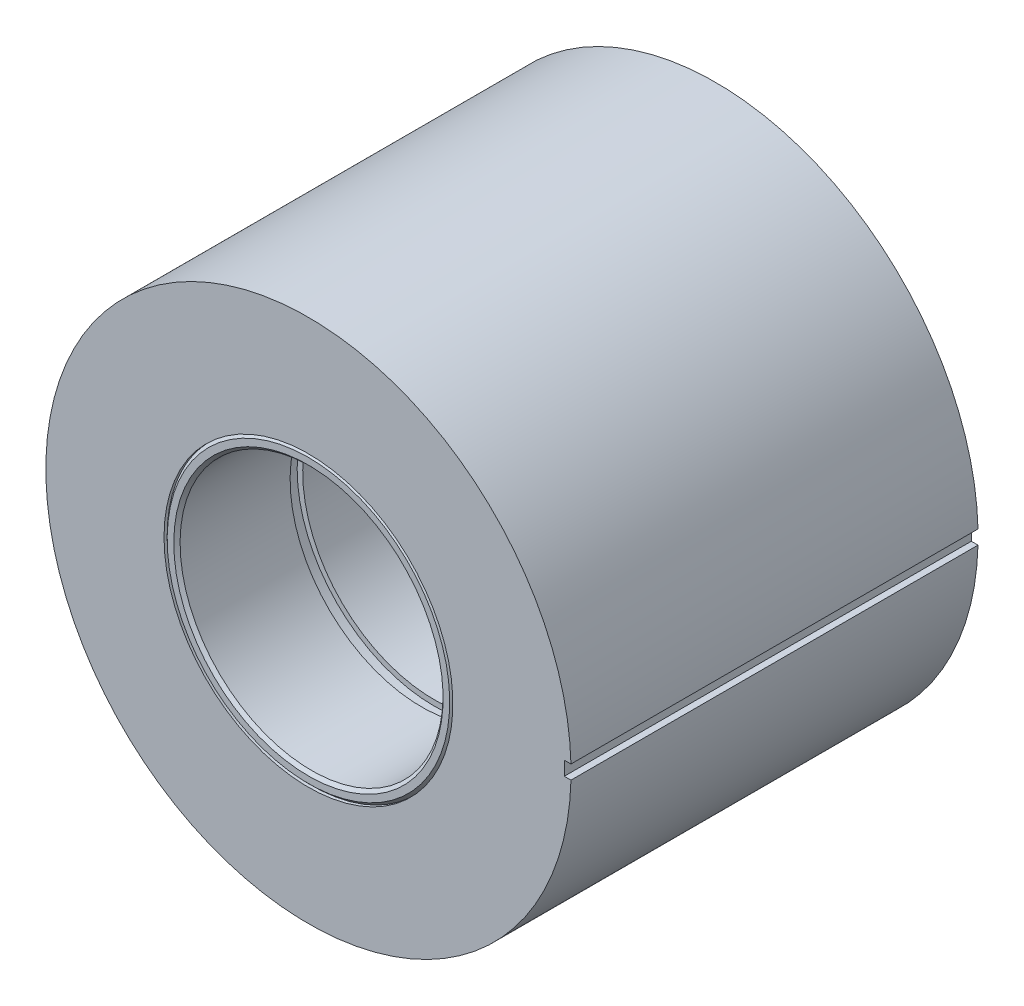
ISO-10303-21;
HEADER;
FILE_DESCRIPTION(('STEP AP214'),'2;1');
FILE_NAME('part.step','',(''),(''),'','','');
FILE_SCHEMA(('AUTOMOTIVE_DESIGN { 1 0 10303 214 1 1 1 1 }'));
ENDSEC;
DATA;
#1=APPLICATION_CONTEXT('core data for automotive mechanical design processes');
#2=APPLICATION_PROTOCOL_DEFINITION('international standard','automotive_design',2000,#1);
#3=PRODUCT_CONTEXT('',#1,'mechanical');
#4=PRODUCT('Part','Part','',(#3));
#5=PRODUCT_RELATED_PRODUCT_CATEGORY('part','',(#4));
#6=PRODUCT_DEFINITION_FORMATION('','',#4);
#7=PRODUCT_DEFINITION_CONTEXT('part definition',#1,'design');
#8=PRODUCT_DEFINITION('design','',#6,#7);
#9=PRODUCT_DEFINITION_SHAPE('','',#8);
#10=(LENGTH_UNIT() NAMED_UNIT(*) SI_UNIT(.MILLI.,.METRE.));
#11=(NAMED_UNIT(*) PLANE_ANGLE_UNIT() SI_UNIT($,.RADIAN.));
#12=(NAMED_UNIT(*) SI_UNIT($,.STERADIAN.) SOLID_ANGLE_UNIT());
#13=UNCERTAINTY_MEASURE_WITH_UNIT(LENGTH_MEASURE(1.E-05),#10,'distance_accuracy_value','');
#14=(GEOMETRIC_REPRESENTATION_CONTEXT(3) GLOBAL_UNCERTAINTY_ASSIGNED_CONTEXT((#13)) GLOBAL_UNIT_ASSIGNED_CONTEXT((#10,
#11,#12)) REPRESENTATION_CONTEXT('',''));
#15=CARTESIAN_POINT('',(0.,0.,0.));
#16=DIRECTION('',(0.,0.,1.));
#17=DIRECTION('',(1.,0.,0.));
#18=AXIS2_PLACEMENT_3D('',#15,#16,#17);
#19=CARTESIAN_POINT('',(0.,0.,0.));
#20=DIRECTION('',(0.,0.,-1.));
#21=DIRECTION('',(-1.,0.,0.));
#22=AXIS2_PLACEMENT_3D('',#19,#20,#21);
#23=CYLINDRICAL_SURFACE('',#22,17.4625);
#24=CARTESIAN_POINT('',(0.,0.,-49.2125));
#25=DIRECTION('',(0.,0.,-1.));
#26=DIRECTION('',(-1.,0.,0.));
#27=AXIS2_PLACEMENT_3D('',#24,#25,#26);
#28=CIRCLE('',#27,17.4625);
#29=CARTESIAN_POINT('',(-17.4625,0.,-49.2125));
#30=VERTEX_POINT('',#29);
#31=EDGE_CURVE('P0_E100',#30,#30,#28,.T.);
#32=ORIENTED_EDGE('',*,*,#31,.T.);
#33=EDGE_LOOP('',(#32));
#34=FACE_BOUND('',#33,.T.);
#35=CARTESIAN_POINT('',(0.,0.,0.));
#36=DIRECTION('',(0.,0.,-1.));
#37=DIRECTION('',(-1.,0.,0.));
#38=AXIS2_PLACEMENT_3D('',#35,#36,#37);
#39=CIRCLE('',#38,17.4625);
#40=CARTESIAN_POINT('',(-17.4625,0.,0.));
#41=VERTEX_POINT('',#40);
#42=EDGE_CURVE('P0_E107',#41,#41,#39,.T.);
#43=ORIENTED_EDGE('',*,*,#42,.F.);
#44=EDGE_LOOP('',(#43));
#45=FACE_BOUND('',#44,.T.);
#46=ADVANCED_FACE('P0_F38',(#34,#45),#23,.F.);
#47=CARTESIAN_POINT('',(0.,0.,-49.2125));
#48=DIRECTION('',(0.,0.,1.));
#49=DIRECTION('',(1.,0.,0.));
#50=AXIS2_PLACEMENT_3D('',#47,#48,#49);
#51=PLANE('',#50);
#52=DIRECTION('',(0.,1.,0.));
#53=VECTOR('',#52,1.);
#54=CARTESIAN_POINT('',(30.9323552674912,0.8436038931805,-49.2125));
#55=LINE('',#54,#53);
#56=CARTESIAN_POINT('',(30.9323552674912,-0.8436038931805,-49.2125));
#57=VERTEX_POINT('',#56);
#58=CARTESIAN_POINT('',(30.9323552674912,0.8436038931805,-49.2125));
#59=VERTEX_POINT('',#58);
#60=EDGE_CURVE('P0_E81',#57,#59,#55,.T.);
#61=ORIENTED_EDGE('',*,*,#60,.F.);
#62=DIRECTION('',(-1.,0.,0.));
#63=VECTOR('',#62,1.);
#64=CARTESIAN_POINT('',(32.5676447325088,-0.8436038931805,-49.2125));
#65=LINE('',#64,#63);
#66=CARTESIAN_POINT('',(31.7387906586154,-0.8436038931805,-49.2125));
#67=VERTEX_POINT('',#66);
#68=EDGE_CURVE('P0_E93',#67,#57,#65,.T.);
#69=ORIENTED_EDGE('',*,*,#68,.F.);
#70=CARTESIAN_POINT('',(0.,0.,-49.2125));
#71=DIRECTION('',(0.,0.,1.));
#72=DIRECTION('',(1.,0.,0.));
#73=AXIS2_PLACEMENT_3D('',#70,#71,#72);
#74=CIRCLE('',#73,31.75);
#75=CARTESIAN_POINT('',(31.7387906586154,0.8436038931805,-49.2125));
#76=VERTEX_POINT('',#75);
#77=EDGE_CURVE('P0_E104',#76,#67,#74,.T.);
#78=ORIENTED_EDGE('',*,*,#77,.F.);
#79=DIRECTION('',(1.,0.,0.));
#80=VECTOR('',#79,1.);
#81=CARTESIAN_POINT('',(32.5676447325088,0.8436038931805,-49.2125));
#82=LINE('',#81,#80);
#83=EDGE_CURVE('P0_E51',#59,#76,#82,.T.);
#84=ORIENTED_EDGE('',*,*,#83,.F.);
#85=EDGE_LOOP('',(#61,#69,#78,#84));
#86=FACE_BOUND('',#85,.T.);
#87=ORIENTED_EDGE('',*,*,#31,.F.);
#88=EDGE_LOOP('',(#87));
#89=FACE_BOUND('',#88,.T.);
#90=ADVANCED_FACE('P0_F116',(#86,#89),#51,.F.);
#91=CARTESIAN_POINT('',(0.,0.,0.));
#92=DIRECTION('',(0.,0.,1.));
#93=DIRECTION('',(1.,0.,0.));
#94=AXIS2_PLACEMENT_3D('',#91,#92,#93);
#95=PLANE('',#94);
#96=DIRECTION('',(-1.,0.,0.));
#97=VECTOR('',#96,1.);
#98=CARTESIAN_POINT('',(32.5676447325088,-0.8436038931805,0.));
#99=LINE('',#98,#97);
#100=CARTESIAN_POINT('',(31.7387906586154,-0.8436038931805,0.));
#101=VERTEX_POINT('',#100);
#102=CARTESIAN_POINT('',(30.9323552674912,-0.8436038931805,0.));
#103=VERTEX_POINT('',#102);
#104=EDGE_CURVE('P0_E83',#101,#103,#99,.T.);
#105=ORIENTED_EDGE('',*,*,#104,.T.);
#106=DIRECTION('',(0.,1.,0.));
#107=VECTOR('',#106,1.);
#108=CARTESIAN_POINT('',(30.9323552674912,0.8436038931805,0.));
#109=LINE('',#108,#107);
#110=CARTESIAN_POINT('',(30.9323552674912,0.8436038931805,0.));
#111=VERTEX_POINT('',#110);
#112=EDGE_CURVE('P0_E78',#103,#111,#109,.T.);
#113=ORIENTED_EDGE('',*,*,#112,.T.);
#114=DIRECTION('',(1.,0.,0.));
#115=VECTOR('',#114,1.);
#116=CARTESIAN_POINT('',(32.5676447325088,0.8436038931805,0.));
#117=LINE('',#116,#115);
#118=CARTESIAN_POINT('',(31.7387906586154,0.8436038931805,0.));
#119=VERTEX_POINT('',#118);
#120=EDGE_CURVE('P0_E85',#111,#119,#117,.T.);
#121=ORIENTED_EDGE('',*,*,#120,.T.);
#122=CARTESIAN_POINT('',(0.,0.,0.));
#123=DIRECTION('',(0.,0.,1.));
#124=DIRECTION('',(1.,0.,0.));
#125=AXIS2_PLACEMENT_3D('',#122,#123,#124);
#126=CIRCLE('',#125,31.75);
#127=EDGE_CURVE('P0_E102',#101,#119,#126,.F.);
#128=ORIENTED_EDGE('',*,*,#127,.F.);
#129=EDGE_LOOP('',(#105,#113,#121,#128));
#130=FACE_BOUND('',#129,.T.);
#131=ORIENTED_EDGE('',*,*,#42,.T.);
#132=EDGE_LOOP('',(#131));
#133=FACE_BOUND('',#132,.T.);
#134=ADVANCED_FACE('P0_F91',(#130,#133),#95,.T.);
#135=CARTESIAN_POINT('',(0.,0.,-49.2125));
#136=DIRECTION('',(0.,0.,1.));
#137=DIRECTION('',(1.,0.,0.));
#138=AXIS2_PLACEMENT_3D('',#135,#136,#137);
#139=CYLINDRICAL_SURFACE('',#138,31.75);
#140=DIRECTION('',(0.,0.,1.));
#141=VECTOR('',#140,1.);
#142=CARTESIAN_POINT('',(31.7387906586154,-0.8436038931805,-49.2125));
#143=LINE('',#142,#141);
#144=EDGE_CURVE('P0_E12',#101,#67,#143,.F.);
#145=ORIENTED_EDGE('',*,*,#144,.F.);
#146=ORIENTED_EDGE('',*,*,#127,.T.);
#147=DIRECTION('',(0.,0.,1.));
#148=VECTOR('',#147,1.);
#149=CARTESIAN_POINT('',(31.7387906586154,0.8436038931805,-49.2125));
#150=LINE('',#149,#148);
#151=EDGE_CURVE('P0_E44',#76,#119,#150,.T.);
#152=ORIENTED_EDGE('',*,*,#151,.F.);
#153=ORIENTED_EDGE('',*,*,#77,.T.);
#154=EDGE_LOOP('',(#145,#146,#152,#153));
#155=FACE_BOUND('',#154,.T.);
#156=ADVANCED_FACE('P0_F123',(#155),#139,.T.);
#157=CARTESIAN_POINT('',(30.9323552674912,0.8436038931805,0.));
#158=DIRECTION('',(-1.,0.,0.));
#159=DIRECTION('',(0.,0.,1.));
#160=AXIS2_PLACEMENT_3D('',#157,#158,#159);
#161=PLANE('',#160);
#162=ORIENTED_EDGE('',*,*,#60,.T.);
#163=DIRECTION('',(0.,0.,-1.));
#164=VECTOR('',#163,1.);
#165=CARTESIAN_POINT('',(30.9323552674912,0.8436038931805,0.));
#166=LINE('',#165,#164);
#167=EDGE_CURVE('P0_E74',#111,#59,#166,.T.);
#168=ORIENTED_EDGE('',*,*,#167,.F.);
#169=ORIENTED_EDGE('',*,*,#112,.F.);
#170=DIRECTION('',(0.,0.,-1.));
#171=VECTOR('',#170,1.);
#172=CARTESIAN_POINT('',(30.9323552674912,-0.8436038931805,0.));
#173=LINE('',#172,#171);
#174=EDGE_CURVE('P0_E82',#103,#57,#173,.T.);
#175=ORIENTED_EDGE('',*,*,#174,.T.);
#176=EDGE_LOOP('',(#162,#168,#169,#175));
#177=FACE_BOUND('',#176,.T.);
#178=ADVANCED_FACE('P0_F75',(#177),#161,.F.);
#179=CARTESIAN_POINT('',(32.5676447325088,-0.8436038931805,0.));
#180=DIRECTION('',(0.,-1.,0.));
#181=DIRECTION('',(0.,0.,-1.));
#182=AXIS2_PLACEMENT_3D('',#179,#180,#181);
#183=PLANE('',#182);
#184=ORIENTED_EDGE('',*,*,#144,.T.);
#185=ORIENTED_EDGE('',*,*,#68,.T.);
#186=ORIENTED_EDGE('',*,*,#174,.F.);
#187=ORIENTED_EDGE('',*,*,#104,.F.);
#188=EDGE_LOOP('',(#184,#185,#186,#187));
#189=FACE_BOUND('',#188,.T.);
#190=ADVANCED_FACE('P0_F131',(#189),#183,.F.);
#191=CARTESIAN_POINT('',(32.5676447325088,0.8436038931805,0.));
#192=DIRECTION('',(0.,1.,0.));
#193=DIRECTION('',(0.,0.,1.));
#194=AXIS2_PLACEMENT_3D('',#191,#192,#193);
#195=PLANE('',#194);
#196=ORIENTED_EDGE('',*,*,#151,.T.);
#197=ORIENTED_EDGE('',*,*,#120,.F.);
#198=ORIENTED_EDGE('',*,*,#167,.T.);
#199=ORIENTED_EDGE('',*,*,#83,.T.);
#200=EDGE_LOOP('',(#196,#197,#198,#199));
#201=FACE_BOUND('',#200,.T.);
#202=ADVANCED_FACE('P0_F86',(#201),#195,.F.);
#203=CLOSED_SHELL('',(#46,#90,#134,#156,#178,#190,#202));
#204=MANIFOLD_SOLID_BREP('P0_B2',#203);
#205=CARTESIAN_POINT('',(0.,0.,-49.2125));
#206=DIRECTION('',(0.,0.,1.));
#207=DIRECTION('',(-0.923728021347068,-0.383049008063238,0.));
#208=AXIS2_PLACEMENT_3D('',#205,#206,#207);
#209=CYLINDRICAL_SURFACE('',#208,15.9004);
#210=CARTESIAN_POINT('',(0.,0.,-15.20825));
#211=DIRECTION('',(0.,0.,1.));
#212=DIRECTION('',(-0.923728021347068,-0.383049008063238,0.));
#213=AXIS2_PLACEMENT_3D('',#210,#211,#212);
#214=CIRCLE('',#213,15.9004);
#215=CARTESIAN_POINT('',(-14.6876450306269,-6.0906324478087,-15.20825));
#216=VERTEX_POINT('',#215);
#217=EDGE_CURVE('P1_E63',#216,#216,#214,.T.);
#218=ORIENTED_EDGE('',*,*,#217,.T.);
#219=EDGE_LOOP('',(#218));
#220=FACE_BOUND('',#219,.T.);
#221=CARTESIAN_POINT('',(0.,0.,-34.00425));
#222=DIRECTION('',(0.,0.,1.));
#223=DIRECTION('',(-0.923728021347068,-0.383049008063238,0.));
#224=AXIS2_PLACEMENT_3D('',#221,#222,#223);
#225=CIRCLE('',#224,15.9004);
#226=CARTESIAN_POINT('',(-14.6876450306269,-6.0906324478087,-34.00425));
#227=VERTEX_POINT('',#226);
#228=EDGE_CURVE('P1_E17',#227,#227,#225,.T.);
#229=ORIENTED_EDGE('',*,*,#228,.F.);
#230=EDGE_LOOP('',(#229));
#231=FACE_BOUND('',#230,.T.);
#232=ADVANCED_FACE('P1_F14',(#220,#231),#209,.F.);
#233=CARTESIAN_POINT('',(0.,0.,-34.00425));
#234=DIRECTION('',(0.,0.,-1.));
#235=DIRECTION('',(0.923728021347068,0.383049008063238,0.));
#236=AXIS2_PLACEMENT_3D('',#233,#234,#235);
#237=PLANE('',#236);
#238=CARTESIAN_POINT('',(0.,0.,-34.00425));
#239=DIRECTION('',(0.,0.,1.));
#240=DIRECTION('',(-0.923728021347068,-0.383049008063238,0.));
#241=AXIS2_PLACEMENT_3D('',#238,#239,#240);
#242=CIRCLE('',#241,16.5735);
#243=CARTESIAN_POINT('',(-15.3094063617956,-6.34846273513607,-34.00425));
#244=VERTEX_POINT('',#243);
#245=EDGE_CURVE('P1_E61',#244,#244,#242,.F.);
#246=ORIENTED_EDGE('',*,*,#245,.T.);
#247=EDGE_LOOP('',(#246));
#248=FACE_BOUND('',#247,.T.);
#249=ORIENTED_EDGE('',*,*,#228,.T.);
#250=EDGE_LOOP('',(#249));
#251=FACE_BOUND('',#250,.T.);
#252=ADVANCED_FACE('P1_F70',(#248,#251),#237,.T.);
#253=CARTESIAN_POINT('',(0.,0.,-15.20825));
#254=DIRECTION('',(0.,0.,-1.));
#255=DIRECTION('',(0.923728021347068,0.383049008063238,0.));
#256=AXIS2_PLACEMENT_3D('',#253,#254,#255);
#257=PLANE('',#256);
#258=CARTESIAN_POINT('',(0.,0.,-15.20825));
#259=DIRECTION('',(0.,0.,-1.));
#260=DIRECTION('',(0.923728021347068,0.383049008063238,0.));
#261=AXIS2_PLACEMENT_3D('',#258,#259,#260);
#262=CIRCLE('',#261,16.5735);
#263=CARTESIAN_POINT('',(15.3094063617956,6.34846273513607,-15.20825));
#264=VERTEX_POINT('',#263);
#265=EDGE_CURVE('P1_E58',#264,#264,#262,.F.);
#266=ORIENTED_EDGE('',*,*,#265,.T.);
#267=EDGE_LOOP('',(#266));
#268=FACE_BOUND('',#267,.T.);
#269=ORIENTED_EDGE('',*,*,#217,.F.);
#270=EDGE_LOOP('',(#269));
#271=FACE_BOUND('',#270,.T.);
#272=ADVANCED_FACE('P1_F77',(#268,#271),#257,.F.);
#273=CARTESIAN_POINT('',(0.,0.,-35.52825));
#274=DIRECTION('',(0.,0.,1.));
#275=DIRECTION('',(-0.923728021347068,-0.383049008063238,0.));
#276=AXIS2_PLACEMENT_3D('',#273,#274,#275);
#277=CYLINDRICAL_SURFACE('',#276,16.5735);
#278=ORIENTED_EDGE('',*,*,#245,.F.);
#279=EDGE_LOOP('',(#278));
#280=FACE_BOUND('',#279,.T.);
#281=CARTESIAN_POINT('',(0.,0.,-35.52825));
#282=DIRECTION('',(0.,0.,1.));
#283=DIRECTION('',(-0.923728021347068,-0.383049008063238,0.));
#284=AXIS2_PLACEMENT_3D('',#281,#282,#283);
#285=CIRCLE('',#284,16.5735);
#286=CARTESIAN_POINT('',(-15.3094063617956,-6.34846273513607,-35.52825));
#287=VERTEX_POINT('',#286);
#288=EDGE_CURVE('P1_E55',#287,#287,#285,.F.);
#289=ORIENTED_EDGE('',*,*,#288,.T.);
#290=EDGE_LOOP('',(#289));
#291=FACE_BOUND('',#290,.T.);
#292=ADVANCED_FACE('P1_F129',(#280,#291),#277,.F.);
#293=CARTESIAN_POINT('',(0.,0.,-13.68425));
#294=DIRECTION('',(0.,0.,-1.));
#295=DIRECTION('',(0.923728021347068,0.383049008063238,0.));
#296=AXIS2_PLACEMENT_3D('',#293,#294,#295);
#297=CYLINDRICAL_SURFACE('',#296,16.5735);
#298=ORIENTED_EDGE('',*,*,#265,.F.);
#299=EDGE_LOOP('',(#298));
#300=FACE_BOUND('',#299,.T.);
#301=CARTESIAN_POINT('',(0.,0.,-13.68425));
#302=DIRECTION('',(0.,0.,-1.));
#303=DIRECTION('',(0.923728021347068,0.383049008063238,0.));
#304=AXIS2_PLACEMENT_3D('',#301,#302,#303);
#305=CIRCLE('',#304,16.5735);
#306=CARTESIAN_POINT('',(15.3094063617956,6.34846273513607,-13.68425));
#307=VERTEX_POINT('',#306);
#308=EDGE_CURVE('P1_E52',#307,#307,#305,.T.);
#309=ORIENTED_EDGE('',*,*,#308,.F.);
#310=EDGE_LOOP('',(#309));
#311=FACE_BOUND('',#310,.T.);
#312=ADVANCED_FACE('P1_F125',(#300,#311),#297,.F.);
#313=CARTESIAN_POINT('',(0.,0.,-35.52825));
#314=DIRECTION('',(0.,0.,-1.));
#315=DIRECTION('',(0.923728021347068,0.383049008063238,0.));
#316=AXIS2_PLACEMENT_3D('',#313,#314,#315);
#317=PLANE('',#316);
#318=ORIENTED_EDGE('',*,*,#288,.F.);
#319=EDGE_LOOP('',(#318));
#320=FACE_BOUND('',#319,.T.);
#321=CARTESIAN_POINT('',(0.,0.,-35.52825));
#322=DIRECTION('',(0.,0.,1.));
#323=DIRECTION('',(-0.923728021347068,-0.383049008063238,0.));
#324=AXIS2_PLACEMENT_3D('',#321,#322,#323);
#325=CIRCLE('',#324,15.9004);
#326=CARTESIAN_POINT('',(-14.6876450306269,-6.0906324478087,-35.52825));
#327=VERTEX_POINT('',#326);
#328=EDGE_CURVE('P1_E49',#327,#327,#325,.F.);
#329=ORIENTED_EDGE('',*,*,#328,.T.);
#330=EDGE_LOOP('',(#329));
#331=FACE_BOUND('',#330,.T.);
#332=ADVANCED_FACE('P1_F121',(#320,#331),#317,.F.);
#333=CARTESIAN_POINT('',(0.,0.,-13.68425));
#334=DIRECTION('',(0.,0.,-1.));
#335=DIRECTION('',(0.923728021347068,0.383049008063238,0.));
#336=AXIS2_PLACEMENT_3D('',#333,#334,#335);
#337=PLANE('',#336);
#338=ORIENTED_EDGE('',*,*,#308,.T.);
#339=EDGE_LOOP('',(#338));
#340=FACE_BOUND('',#339,.T.);
#341=CARTESIAN_POINT('',(0.,0.,-13.68425));
#342=DIRECTION('',(0.,0.,1.));
#343=DIRECTION('',(-0.923728021347068,-0.383049008063238,0.));
#344=AXIS2_PLACEMENT_3D('',#341,#342,#343);
#345=CIRCLE('',#344,15.9004);
#346=CARTESIAN_POINT('',(-14.6876450306269,-6.0906324478087,-13.68425));
#347=VERTEX_POINT('',#346);
#348=EDGE_CURVE('P1_E36',#347,#347,#345,.T.);
#349=ORIENTED_EDGE('',*,*,#348,.T.);
#350=EDGE_LOOP('',(#349));
#351=FACE_BOUND('',#350,.T.);
#352=ADVANCED_FACE('P1_F117',(#340,#351),#337,.T.);
#353=CARTESIAN_POINT('',(0.,0.,-49.2125));
#354=DIRECTION('',(0.,0.,1.));
#355=DIRECTION('',(-0.923728021347068,-0.383049008063238,0.));
#356=AXIS2_PLACEMENT_3D('',#353,#354,#355);
#357=CYLINDRICAL_SURFACE('',#356,15.9004);
#358=CARTESIAN_POINT('',(0.,0.,-48.8315));
#359=DIRECTION('',(0.,0.,-1.));
#360=DIRECTION('',(0.923728021347068,0.383049008063238,0.));
#361=AXIS2_PLACEMENT_3D('',#358,#359,#360);
#362=CIRCLE('',#361,15.9004);
#363=CARTESIAN_POINT('',(14.6876450306269,6.0906324478087,-48.8315));
#364=VERTEX_POINT('',#363);
#365=EDGE_CURVE('P1_E33',#364,#364,#362,.T.);
#366=ORIENTED_EDGE('',*,*,#365,.T.);
#367=EDGE_LOOP('',(#366));
#368=FACE_BOUND('',#367,.T.);
#369=ORIENTED_EDGE('',*,*,#328,.F.);
#370=EDGE_LOOP('',(#369));
#371=FACE_BOUND('',#370,.T.);
#372=ADVANCED_FACE('P1_F113',(#368,#371),#357,.F.);
#373=CARTESIAN_POINT('',(0.,0.,-49.2125));
#374=DIRECTION('',(0.,0.,1.));
#375=DIRECTION('',(-0.923728021347068,-0.383049008063238,0.));
#376=AXIS2_PLACEMENT_3D('',#373,#374,#375);
#377=CYLINDRICAL_SURFACE('',#376,15.9004);
#378=CARTESIAN_POINT('',(0.,0.,-0.381000000000006));
#379=DIRECTION('',(0.,0.,1.));
#380=DIRECTION('',(-0.923728021347068,-0.383049008063238,0.));
#381=AXIS2_PLACEMENT_3D('',#378,#379,#380);
#382=CIRCLE('',#381,15.9004);
#383=CARTESIAN_POINT('',(-14.6876450306269,-6.0906324478087,-0.381000000000006));
#384=VERTEX_POINT('',#383);
#385=EDGE_CURVE('P1_E29',#384,#384,#382,.T.);
#386=ORIENTED_EDGE('',*,*,#385,.T.);
#387=EDGE_LOOP('',(#386));
#388=FACE_BOUND('',#387,.T.);
#389=ORIENTED_EDGE('',*,*,#348,.F.);
#390=EDGE_LOOP('',(#389));
#391=FACE_BOUND('',#390,.T.);
#392=ADVANCED_FACE('P1_F109',(#388,#391),#377,.F.);
#393=CARTESIAN_POINT('',(0.,0.,-49.2125));
#394=DIRECTION('',(0.,0.,-1.));
#395=DIRECTION('',(-0.383049008063238,0.923728021347068,0.));
#396=AXIS2_PLACEMENT_3D('',#393,#394,#395);
#397=CONICAL_SURFACE('',#396,16.2814,0.785398163397444);
#398=ORIENTED_EDGE('',*,*,#365,.F.);
#399=EDGE_LOOP('',(#398));
#400=FACE_BOUND('',#399,.T.);
#401=CARTESIAN_POINT('',(0.,0.,-49.2125));
#402=DIRECTION('',(0.,0.,-1.));
#403=DIRECTION('',(-0.383049008063238,0.923728021347068,0.));
#404=AXIS2_PLACEMENT_3D('',#401,#402,#403);
#405=CIRCLE('',#404,16.2814);
#406=CARTESIAN_POINT('',(-6.2365741198808,15.0395854067602,-49.2125));
#407=VERTEX_POINT('',#406);
#408=EDGE_CURVE('P1_E32',#407,#407,#405,.F.);
#409=ORIENTED_EDGE('',*,*,#408,.F.);
#410=EDGE_LOOP('',(#409));
#411=FACE_BOUND('',#410,.T.);
#412=ADVANCED_FACE('P1_F105',(#400,#411),#397,.F.);
#413=CARTESIAN_POINT('',(0.,0.,0.));
#414=DIRECTION('',(0.,0.,1.));
#415=DIRECTION('',(-0.923728021347068,-0.383049008063238,0.));
#416=AXIS2_PLACEMENT_3D('',#413,#414,#415);
#417=CONICAL_SURFACE('',#416,16.2814,0.785398163397444);
#418=CARTESIAN_POINT('',(0.,0.,0.));
#419=DIRECTION('',(0.,0.,1.));
#420=DIRECTION('',(-0.923728021347068,-0.383049008063238,0.));
#421=AXIS2_PLACEMENT_3D('',#418,#419,#420);
#422=CIRCLE('',#421,16.2814);
#423=CARTESIAN_POINT('',(-15.0395854067602,-6.2365741198808,0.));
#424=VERTEX_POINT('',#423);
#425=EDGE_CURVE('P1_E42',#424,#424,#422,.T.);
#426=ORIENTED_EDGE('',*,*,#425,.T.);
#427=EDGE_LOOP('',(#426));
#428=FACE_BOUND('',#427,.T.);
#429=ORIENTED_EDGE('',*,*,#385,.F.);
#430=EDGE_LOOP('',(#429));
#431=FACE_BOUND('',#430,.T.);
#432=ADVANCED_FACE('P1_F101',(#428,#431),#417,.F.);
#433=CARTESIAN_POINT('',(0.,0.,-49.2125));
#434=DIRECTION('',(0.,0.,-1.));
#435=DIRECTION('',(0.923728021347068,0.383049008063238,0.));
#436=AXIS2_PLACEMENT_3D('',#433,#434,#435);
#437=PLANE('',#436);
#438=CARTESIAN_POINT('',(0.,0.,-49.2125));
#439=DIRECTION('',(0.,0.,1.));
#440=DIRECTION('',(0.383049008063238,-0.923728021347068,0.));
#441=AXIS2_PLACEMENT_3D('',#438,#439,#440);
#442=CIRCLE('',#441,17.0815);
#443=CARTESIAN_POINT('',(6.54305163123219,-15.7786601966399,-49.2125));
#444=VERTEX_POINT('',#443);
#445=EDGE_CURVE('P1_E39',#444,#444,#442,.T.);
#446=ORIENTED_EDGE('',*,*,#445,.F.);
#447=EDGE_LOOP('',(#446));
#448=FACE_BOUND('',#447,.T.);
#449=ORIENTED_EDGE('',*,*,#408,.T.);
#450=EDGE_LOOP('',(#449));
#451=FACE_BOUND('',#450,.T.);
#452=ADVANCED_FACE('P1_F97',(#448,#451),#437,.T.);
#453=CARTESIAN_POINT('',(0.,0.,0.));
#454=DIRECTION('',(0.,0.,-1.));
#455=DIRECTION('',(0.923728021347068,0.383049008063238,0.));
#456=AXIS2_PLACEMENT_3D('',#453,#454,#455);
#457=PLANE('',#456);
#458=CARTESIAN_POINT('',(0.,0.,0.));
#459=DIRECTION('',(0.,0.,-1.));
#460=DIRECTION('',(-0.383049008063238,0.923728021347068,0.));
#461=AXIS2_PLACEMENT_3D('',#458,#459,#460);
#462=CIRCLE('',#461,17.0815);
#463=CARTESIAN_POINT('',(-6.54305163123219,15.7786601966399,0.));
#464=VERTEX_POINT('',#463);
#465=EDGE_CURVE('P1_E26',#464,#464,#462,.T.);
#466=ORIENTED_EDGE('',*,*,#465,.F.);
#467=EDGE_LOOP('',(#466));
#468=FACE_BOUND('',#467,.T.);
#469=ORIENTED_EDGE('',*,*,#425,.F.);
#470=EDGE_LOOP('',(#469));
#471=FACE_BOUND('',#470,.T.);
#472=ADVANCED_FACE('P1_F93',(#468,#471),#457,.F.);
#473=CARTESIAN_POINT('',(0.,0.,-48.8315));
#474=DIRECTION('',(0.,0.,1.));
#475=DIRECTION('',(0.383049008063238,-0.923728021347068,0.));
#476=AXIS2_PLACEMENT_3D('',#473,#474,#475);
#477=CONICAL_SURFACE('',#476,17.4625,0.785398163397444);
#478=CARTESIAN_POINT('',(0.,0.,-48.8315));
#479=DIRECTION('',(0.,0.,1.));
#480=DIRECTION('',(-0.923728021347068,-0.383049008063238,0.));
#481=AXIS2_PLACEMENT_3D('',#478,#479,#480);
#482=CIRCLE('',#481,17.4625);
#483=CARTESIAN_POINT('',(-16.1306005727732,-6.68899330330429,-48.8315));
#484=VERTEX_POINT('',#483);
#485=EDGE_CURVE('P1_E21',#484,#484,#482,.T.);
#486=ORIENTED_EDGE('',*,*,#485,.F.);
#487=EDGE_LOOP('',(#486));
#488=FACE_BOUND('',#487,.T.);
#489=ORIENTED_EDGE('',*,*,#445,.T.);
#490=EDGE_LOOP('',(#489));
#491=FACE_BOUND('',#490,.T.);
#492=ADVANCED_FACE('P1_F86',(#488,#491),#477,.T.);
#493=CARTESIAN_POINT('',(0.,0.,-0.381000000000006));
#494=DIRECTION('',(0.,0.,-1.));
#495=DIRECTION('',(-0.383049008063238,0.923728021347068,0.));
#496=AXIS2_PLACEMENT_3D('',#493,#494,#495);
#497=CONICAL_SURFACE('',#496,17.4625,0.785398163397444);
#498=CARTESIAN_POINT('',(0.,0.,-0.381000000000006));
#499=DIRECTION('',(0.,0.,1.));
#500=DIRECTION('',(-0.923728021347068,-0.383049008063238,0.));
#501=AXIS2_PLACEMENT_3D('',#498,#499,#500);
#502=CIRCLE('',#501,17.4625);
#503=CARTESIAN_POINT('',(-16.1306005727732,-6.68899330330429,-0.381000000000006));
#504=VERTEX_POINT('',#503);
#505=EDGE_CURVE('P1_E10',#504,#504,#502,.F.);
#506=ORIENTED_EDGE('',*,*,#505,.F.);
#507=EDGE_LOOP('',(#506));
#508=FACE_BOUND('',#507,.T.);
#509=ORIENTED_EDGE('',*,*,#465,.T.);
#510=EDGE_LOOP('',(#509));
#511=FACE_BOUND('',#510,.T.);
#512=ADVANCED_FACE('P1_F81',(#508,#511),#497,.T.);
#513=CARTESIAN_POINT('',(0.,0.,-49.2125));
#514=DIRECTION('',(0.,0.,1.));
#515=DIRECTION('',(-0.923728021347068,-0.383049008063238,0.));
#516=AXIS2_PLACEMENT_3D('',#513,#514,#515);
#517=CYLINDRICAL_SURFACE('',#516,17.4625);
#518=ORIENTED_EDGE('',*,*,#505,.T.);
#519=EDGE_LOOP('',(#518));
#520=FACE_BOUND('',#519,.T.);
#521=ORIENTED_EDGE('',*,*,#485,.T.);
#522=EDGE_LOOP('',(#521));
#523=FACE_BOUND('',#522,.T.);
#524=ADVANCED_FACE('P1_F79',(#520,#523),#517,.T.);
#525=CLOSED_SHELL('',(#232,#252,#272,#292,#312,#332,#352,#372,#392,#412,#432,#452,#472,#492,
#512,#524));
#526=MANIFOLD_SOLID_BREP('P1_B1',#525);
#527=ADVANCED_BREP_SHAPE_REPRESENTATION('',(#18,#204,#526),#14);
#528=SHAPE_DEFINITION_REPRESENTATION(#9,#527);
ENDSEC;
END-ISO-10303-21;
